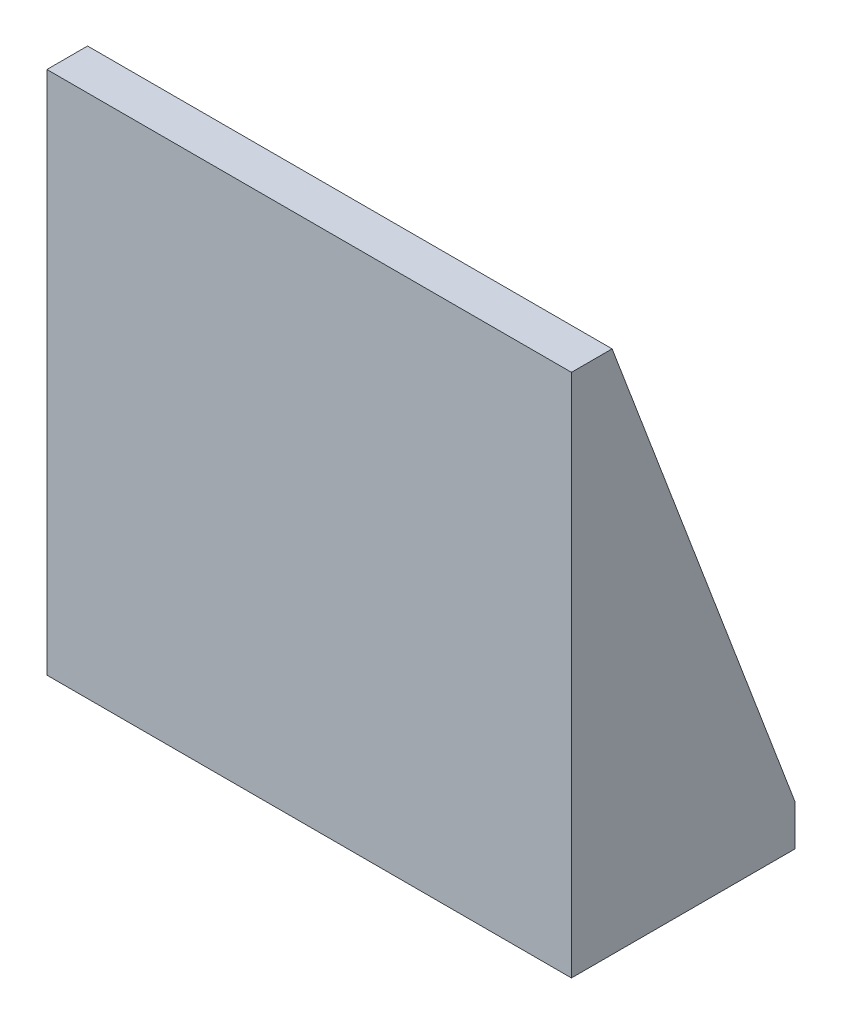
ISO-10303-21;
HEADER;
FILE_DESCRIPTION(('STEP AP214'),'2;1');
FILE_NAME('part.step','',(''),(''),'','','');
FILE_SCHEMA(('AUTOMOTIVE_DESIGN { 1 0 10303 214 1 1 1 1 }'));
ENDSEC;
DATA;
#1=APPLICATION_CONTEXT('core data for automotive mechanical design processes');
#2=APPLICATION_PROTOCOL_DEFINITION('international standard','automotive_design',2000,#1);
#3=PRODUCT_CONTEXT('',#1,'mechanical');
#4=PRODUCT('Part','Part','',(#3));
#5=PRODUCT_RELATED_PRODUCT_CATEGORY('part','',(#4));
#6=PRODUCT_DEFINITION_FORMATION('','',#4);
#7=PRODUCT_DEFINITION_CONTEXT('part definition',#1,'design');
#8=PRODUCT_DEFINITION('design','',#6,#7);
#9=PRODUCT_DEFINITION_SHAPE('','',#8);
#10=(LENGTH_UNIT() NAMED_UNIT(*) SI_UNIT(.MILLI.,.METRE.));
#11=(NAMED_UNIT(*) PLANE_ANGLE_UNIT() SI_UNIT($,.RADIAN.));
#12=(NAMED_UNIT(*) SI_UNIT($,.STERADIAN.) SOLID_ANGLE_UNIT());
#13=UNCERTAINTY_MEASURE_WITH_UNIT(LENGTH_MEASURE(1.E-05),#10,'distance_accuracy_value','');
#14=(GEOMETRIC_REPRESENTATION_CONTEXT(3) GLOBAL_UNCERTAINTY_ASSIGNED_CONTEXT((#13)) GLOBAL_UNIT_ASSIGNED_CONTEXT((#10,
#11,#12)) REPRESENTATION_CONTEXT('',''));
#15=CARTESIAN_POINT('',(0.,0.,0.));
#16=DIRECTION('',(0.,0.,1.));
#17=DIRECTION('',(1.,0.,0.));
#18=AXIS2_PLACEMENT_3D('',#15,#16,#17);
#19=CARTESIAN_POINT('',(64.5,0.,-10.));
#20=DIRECTION('',(0.,0.,1.));
#21=DIRECTION('',(1.,0.,0.));
#22=AXIS2_PLACEMENT_3D('',#19,#20,#21);
#23=PLANE('',#22);
#24=DIRECTION('',(0.,-1.,0.));
#25=VECTOR('',#24,1.);
#26=CARTESIAN_POINT('',(-54.5,10.,-10.));
#27=LINE('',#26,#25);
#28=CARTESIAN_POINT('',(-54.5,129.,-10.));
#29=VERTEX_POINT('',#28);
#30=CARTESIAN_POINT('',(-54.5,10.,-10.));
#31=VERTEX_POINT('',#30);
#32=EDGE_CURVE('E53',#29,#31,#27,.T.);
#33=ORIENTED_EDGE('',*,*,#32,.F.);
#34=DIRECTION('',(-1.,0.,0.));
#35=VECTOR('',#34,1.);
#36=CARTESIAN_POINT('',(64.5,129.,-10.));
#37=LINE('',#36,#35);
#38=CARTESIAN_POINT('',(54.5,129.,-10.));
#39=VERTEX_POINT('',#38);
#40=EDGE_CURVE('E39',#39,#29,#37,.T.);
#41=ORIENTED_EDGE('',*,*,#40,.F.);
#42=DIRECTION('',(0.,-1.,0.));
#43=VECTOR('',#42,1.);
#44=CARTESIAN_POINT('',(54.5,10.,-10.));
#45=LINE('',#44,#43);
#46=CARTESIAN_POINT('',(54.5,10.,-10.));
#47=VERTEX_POINT('',#46);
#48=EDGE_CURVE('E102',#39,#47,#45,.T.);
#49=ORIENTED_EDGE('',*,*,#48,.T.);
#50=DIRECTION('',(-1.,0.,0.));
#51=VECTOR('',#50,1.);
#52=CARTESIAN_POINT('',(64.5,10.,-10.));
#53=LINE('',#52,#51);
#54=EDGE_CURVE('E107',#47,#31,#53,.T.);
#55=ORIENTED_EDGE('',*,*,#54,.T.);
#56=EDGE_LOOP('',(#33,#41,#49,#55));
#57=FACE_BOUND('',#56,.T.);
#58=ADVANCED_FACE('F32',(#57),#23,.F.);
#59=CARTESIAN_POINT('',(64.5,10.,0.));
#60=DIRECTION('',(0.,-1.,0.));
#61=DIRECTION('',(0.,0.,-1.));
#62=AXIS2_PLACEMENT_3D('',#59,#60,#61);
#63=PLANE('',#62);
#64=DIRECTION('',(0.,0.,-1.));
#65=VECTOR('',#64,1.);
#66=CARTESIAN_POINT('',(-54.5,10.,-55.));
#67=LINE('',#66,#65);
#68=CARTESIAN_POINT('',(-54.5,10.,-55.));
#69=VERTEX_POINT('',#68);
#70=EDGE_CURVE('E46',#31,#69,#67,.T.);
#71=ORIENTED_EDGE('',*,*,#70,.F.);
#72=ORIENTED_EDGE('',*,*,#54,.F.);
#73=DIRECTION('',(0.,0.,-1.));
#74=VECTOR('',#73,1.);
#75=CARTESIAN_POINT('',(54.5,10.,-55.));
#76=LINE('',#75,#74);
#77=CARTESIAN_POINT('',(54.5,10.,-55.));
#78=VERTEX_POINT('',#77);
#79=EDGE_CURVE('E99',#47,#78,#76,.T.);
#80=ORIENTED_EDGE('',*,*,#79,.T.);
#81=DIRECTION('',(-1.,0.,0.));
#82=VECTOR('',#81,1.);
#83=CARTESIAN_POINT('',(64.5,10.,-55.));
#84=LINE('',#83,#82);
#85=EDGE_CURVE('E111',#78,#69,#84,.T.);
#86=ORIENTED_EDGE('',*,*,#85,.T.);
#87=EDGE_LOOP('',(#71,#72,#80,#86));
#88=FACE_BOUND('',#87,.T.);
#89=ADVANCED_FACE('F110',(#88),#63,.F.);
#90=CARTESIAN_POINT('',(64.5,129.,0.));
#91=DIRECTION('',(0.,1.,0.));
#92=DIRECTION('',(0.,0.,1.));
#93=AXIS2_PLACEMENT_3D('',#90,#91,#92);
#94=PLANE('',#93);
#95=DIRECTION('',(0.,0.,-1.));
#96=VECTOR('',#95,1.);
#97=CARTESIAN_POINT('',(-64.5,129.,0.));
#98=LINE('',#97,#96);
#99=CARTESIAN_POINT('',(-64.5,129.,0.));
#100=VERTEX_POINT('',#99);
#101=CARTESIAN_POINT('',(-64.5,129.,-10.));
#102=VERTEX_POINT('',#101);
#103=EDGE_CURVE('E156',#100,#102,#98,.T.);
#104=ORIENTED_EDGE('',*,*,#103,.F.);
#105=DIRECTION('',(-1.,0.,0.));
#106=VECTOR('',#105,1.);
#107=CARTESIAN_POINT('',(64.5,129.,0.));
#108=LINE('',#107,#106);
#109=CARTESIAN_POINT('',(64.5,129.,0.));
#110=VERTEX_POINT('',#109);
#111=EDGE_CURVE('E126',#110,#100,#108,.T.);
#112=ORIENTED_EDGE('',*,*,#111,.F.);
#113=DIRECTION('',(0.,0.,-1.));
#114=VECTOR('',#113,1.);
#115=CARTESIAN_POINT('',(64.5,129.,0.));
#116=LINE('',#115,#114);
#117=CARTESIAN_POINT('',(64.5,129.,-10.));
#118=VERTEX_POINT('',#117);
#119=EDGE_CURVE('E159',#110,#118,#116,.T.);
#120=ORIENTED_EDGE('',*,*,#119,.T.);
#121=EDGE_CURVE('E11',#118,#39,#37,.T.);
#122=ORIENTED_EDGE('',*,*,#121,.T.);
#123=ORIENTED_EDGE('',*,*,#40,.T.);
#124=DIRECTION('',(-1.,0.,0.));
#125=VECTOR('',#124,1.);
#126=CARTESIAN_POINT('',(-54.5,129.,-10.));
#127=LINE('',#126,#125);
#128=EDGE_CURVE('E135',#29,#102,#127,.T.);
#129=ORIENTED_EDGE('',*,*,#128,.T.);
#130=EDGE_LOOP('',(#104,#112,#120,#122,#123,#129));
#131=FACE_BOUND('',#130,.T.);
#132=ADVANCED_FACE('F133',(#131),#94,.T.);
#133=CARTESIAN_POINT('',(64.5,0.,0.));
#134=DIRECTION('',(0.,0.,1.));
#135=DIRECTION('',(1.,0.,0.));
#136=AXIS2_PLACEMENT_3D('',#133,#134,#135);
#137=PLANE('',#136);
#138=DIRECTION('',(0.,1.,0.));
#139=VECTOR('',#138,1.);
#140=CARTESIAN_POINT('',(-64.5,0.,0.));
#141=LINE('',#140,#139);
#142=CARTESIAN_POINT('',(-64.5,0.,0.));
#143=VERTEX_POINT('',#142);
#144=EDGE_CURVE('E166',#143,#100,#141,.T.);
#145=ORIENTED_EDGE('',*,*,#144,.F.);
#146=DIRECTION('',(-1.,0.,0.));
#147=VECTOR('',#146,1.);
#148=CARTESIAN_POINT('',(64.5,0.,0.));
#149=LINE('',#148,#147);
#150=CARTESIAN_POINT('',(64.5,0.,0.));
#151=VERTEX_POINT('',#150);
#152=EDGE_CURVE('E125',#151,#143,#149,.T.);
#153=ORIENTED_EDGE('',*,*,#152,.F.);
#154=DIRECTION('',(0.,1.,0.));
#155=VECTOR('',#154,1.);
#156=CARTESIAN_POINT('',(64.5,0.,0.));
#157=LINE('',#156,#155);
#158=EDGE_CURVE('E161',#151,#110,#157,.T.);
#159=ORIENTED_EDGE('',*,*,#158,.T.);
#160=ORIENTED_EDGE('',*,*,#111,.T.);
#161=EDGE_LOOP('',(#145,#153,#159,#160));
#162=FACE_BOUND('',#161,.T.);
#163=ADVANCED_FACE('F182',(#162),#137,.T.);
#164=CARTESIAN_POINT('',(64.5,0.,0.));
#165=DIRECTION('',(0.,-1.,0.));
#166=DIRECTION('',(0.,0.,-1.));
#167=AXIS2_PLACEMENT_3D('',#164,#165,#166);
#168=PLANE('',#167);
#169=DIRECTION('',(0.,0.,1.));
#170=VECTOR('',#169,1.);
#171=CARTESIAN_POINT('',(-64.5,0.,0.));
#172=LINE('',#171,#170);
#173=CARTESIAN_POINT('',(-64.5,0.,-55.));
#174=VERTEX_POINT('',#173);
#175=EDGE_CURVE('E168',#174,#143,#172,.T.);
#176=ORIENTED_EDGE('',*,*,#175,.F.);
#177=DIRECTION('',(-1.,0.,0.));
#178=VECTOR('',#177,1.);
#179=CARTESIAN_POINT('',(64.5,0.,-55.));
#180=LINE('',#179,#178);
#181=CARTESIAN_POINT('',(64.5,0.,-55.));
#182=VERTEX_POINT('',#181);
#183=EDGE_CURVE('E123',#182,#174,#180,.T.);
#184=ORIENTED_EDGE('',*,*,#183,.F.);
#185=DIRECTION('',(0.,0.,1.));
#186=VECTOR('',#185,1.);
#187=CARTESIAN_POINT('',(64.5,0.,0.));
#188=LINE('',#187,#186);
#189=EDGE_CURVE('E117',#182,#151,#188,.T.);
#190=ORIENTED_EDGE('',*,*,#189,.T.);
#191=ORIENTED_EDGE('',*,*,#152,.T.);
#192=EDGE_LOOP('',(#176,#184,#190,#191));
#193=FACE_BOUND('',#192,.T.);
#194=ADVANCED_FACE('F180',(#193),#168,.T.);
#195=CARTESIAN_POINT('',(64.5,10.,-55.));
#196=DIRECTION('',(0.,0.,-1.));
#197=DIRECTION('',(-1.,0.,0.));
#198=AXIS2_PLACEMENT_3D('',#195,#196,#197);
#199=PLANE('',#198);
#200=DIRECTION('',(0.,-1.,0.));
#201=VECTOR('',#200,1.);
#202=CARTESIAN_POINT('',(-64.5,10.,-55.));
#203=LINE('',#202,#201);
#204=CARTESIAN_POINT('',(-64.5,10.,-55.));
#205=VERTEX_POINT('',#204);
#206=EDGE_CURVE('E120',#205,#174,#203,.T.);
#207=ORIENTED_EDGE('',*,*,#206,.F.);
#208=DIRECTION('',(-1.,0.,0.));
#209=VECTOR('',#208,1.);
#210=CARTESIAN_POINT('',(-54.5,10.,-55.));
#211=LINE('',#210,#209);
#212=EDGE_CURVE('E149',#69,#205,#211,.T.);
#213=ORIENTED_EDGE('',*,*,#212,.F.);
#214=ORIENTED_EDGE('',*,*,#85,.F.);
#215=CARTESIAN_POINT('',(64.5,10.,-55.));
#216=VERTEX_POINT('',#215);
#217=EDGE_CURVE('E114',#216,#78,#84,.T.);
#218=ORIENTED_EDGE('',*,*,#217,.F.);
#219=DIRECTION('',(0.,-1.,0.));
#220=VECTOR('',#219,1.);
#221=CARTESIAN_POINT('',(64.5,10.,-55.));
#222=LINE('',#221,#220);
#223=EDGE_CURVE('E112',#216,#182,#222,.T.);
#224=ORIENTED_EDGE('',*,*,#223,.T.);
#225=ORIENTED_EDGE('',*,*,#183,.T.);
#226=EDGE_LOOP('',(#207,#213,#214,#218,#224,#225));
#227=FACE_BOUND('',#226,.T.);
#228=ADVANCED_FACE('F175',(#227),#199,.T.);
#229=CARTESIAN_POINT('',(64.5,129.,-10.));
#230=DIRECTION('',(-1.,0.,0.));
#231=DIRECTION('',(0.,0.,1.));
#232=AXIS2_PLACEMENT_3D('',#229,#230,#231);
#233=PLANE('',#232);
#234=DIRECTION('',(0.,0.935356553338471,0.353706259665808));
#235=VECTOR('',#234,1.);
#236=CARTESIAN_POINT('',(64.5,129.,-10.));
#237=LINE('',#236,#235);
#238=EDGE_CURVE('E108',#216,#118,#237,.T.);
#239=ORIENTED_EDGE('',*,*,#238,.T.);
#240=ORIENTED_EDGE('',*,*,#119,.F.);
#241=ORIENTED_EDGE('',*,*,#158,.F.);
#242=ORIENTED_EDGE('',*,*,#189,.F.);
#243=ORIENTED_EDGE('',*,*,#223,.F.);
#244=EDGE_LOOP('',(#239,#240,#241,#242,#243));
#245=FACE_BOUND('',#244,.T.);
#246=ADVANCED_FACE('F185',(#245),#233,.F.);
#247=CARTESIAN_POINT('',(-64.5,129.,-10.));
#248=DIRECTION('',(-1.,0.,0.));
#249=DIRECTION('',(0.,0.,1.));
#250=AXIS2_PLACEMENT_3D('',#247,#248,#249);
#251=PLANE('',#250);
#252=ORIENTED_EDGE('',*,*,#103,.T.);
#253=DIRECTION('',(0.,0.935356553338471,0.353706259665808));
#254=VECTOR('',#253,1.);
#255=CARTESIAN_POINT('',(-64.5,129.,-10.));
#256=LINE('',#255,#254);
#257=EDGE_CURVE('E148',#205,#102,#256,.T.);
#258=ORIENTED_EDGE('',*,*,#257,.F.);
#259=ORIENTED_EDGE('',*,*,#206,.T.);
#260=ORIENTED_EDGE('',*,*,#175,.T.);
#261=ORIENTED_EDGE('',*,*,#144,.T.);
#262=EDGE_LOOP('',(#252,#258,#259,#260,#261));
#263=FACE_BOUND('',#262,.T.);
#264=ADVANCED_FACE('F173',(#263),#251,.T.);
#265=CARTESIAN_POINT('',(54.5,129.,-10.));
#266=DIRECTION('',(0.,0.353706259665808,-0.935356553338471));
#267=DIRECTION('',(0.,0.935356553338471,0.353706259665808));
#268=AXIS2_PLACEMENT_3D('',#265,#266,#267);
#269=PLANE('',#268);
#270=ORIENTED_EDGE('',*,*,#238,.F.);
#271=ORIENTED_EDGE('',*,*,#217,.T.);
#272=DIRECTION('',(0.,0.935356553338471,0.353706259665808));
#273=VECTOR('',#272,1.);
#274=CARTESIAN_POINT('',(54.5,129.,-10.));
#275=LINE('',#274,#273);
#276=EDGE_CURVE('E104',#78,#39,#275,.T.);
#277=ORIENTED_EDGE('',*,*,#276,.T.);
#278=ORIENTED_EDGE('',*,*,#121,.F.);
#279=EDGE_LOOP('',(#270,#271,#277,#278));
#280=FACE_BOUND('',#279,.T.);
#281=ADVANCED_FACE('F187',(#280),#269,.T.);
#282=CARTESIAN_POINT('',(54.5,10.,-10.));
#283=DIRECTION('',(1.,0.,0.));
#284=DIRECTION('',(0.,0.,-1.));
#285=AXIS2_PLACEMENT_3D('',#282,#283,#284);
#286=PLANE('',#285);
#287=ORIENTED_EDGE('',*,*,#48,.F.);
#288=ORIENTED_EDGE('',*,*,#276,.F.);
#289=ORIENTED_EDGE('',*,*,#79,.F.);
#290=EDGE_LOOP('',(#287,#288,#289));
#291=FACE_BOUND('',#290,.T.);
#292=ADVANCED_FACE('F101',(#291),#286,.F.);
#293=CARTESIAN_POINT('',(-54.5,129.,-10.));
#294=DIRECTION('',(0.,-0.353706259665808,0.935356553338471));
#295=DIRECTION('',(0.,-0.935356553338471,-0.353706259665808));
#296=AXIS2_PLACEMENT_3D('',#293,#294,#295);
#297=PLANE('',#296);
#298=ORIENTED_EDGE('',*,*,#257,.T.);
#299=ORIENTED_EDGE('',*,*,#128,.F.);
#300=DIRECTION('',(0.,0.935356553338471,0.353706259665808));
#301=VECTOR('',#300,1.);
#302=CARTESIAN_POINT('',(-54.5,129.,-10.));
#303=LINE('',#302,#301);
#304=EDGE_CURVE('E140',#69,#29,#303,.T.);
#305=ORIENTED_EDGE('',*,*,#304,.F.);
#306=ORIENTED_EDGE('',*,*,#212,.T.);
#307=EDGE_LOOP('',(#298,#299,#305,#306));
#308=FACE_BOUND('',#307,.T.);
#309=ADVANCED_FACE('F146',(#308),#297,.F.);
#310=CARTESIAN_POINT('',(-54.5,10.,-10.));
#311=DIRECTION('',(-1.,0.,0.));
#312=DIRECTION('',(0.,0.,-1.));
#313=AXIS2_PLACEMENT_3D('',#310,#311,#312);
#314=PLANE('',#313);
#315=ORIENTED_EDGE('',*,*,#32,.T.);
#316=ORIENTED_EDGE('',*,*,#70,.T.);
#317=ORIENTED_EDGE('',*,*,#304,.T.);
#318=EDGE_LOOP('',(#315,#316,#317));
#319=FACE_BOUND('',#318,.T.);
#320=ADVANCED_FACE('F141',(#319),#314,.F.);
#321=CLOSED_SHELL('',(#58,#89,#132,#163,#194,#228,#246,#264,#281,#292,#309,#320));
#322=MANIFOLD_SOLID_BREP('B2',#321);
#323=ADVANCED_BREP_SHAPE_REPRESENTATION('',(#18,#322),#14);
#324=SHAPE_DEFINITION_REPRESENTATION(#9,#323);
ENDSEC;
END-ISO-10303-21;
